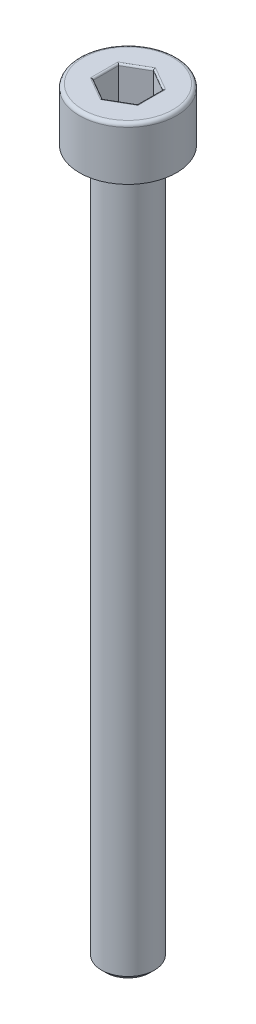
ISO-10303-21;
HEADER;
FILE_DESCRIPTION(('STEP AP214'),'2;1');
FILE_NAME('part.step','',(''),(''),'','','');
FILE_SCHEMA(('AUTOMOTIVE_DESIGN { 1 0 10303 214 1 1 1 1 }'));
ENDSEC;
DATA;
#1=APPLICATION_CONTEXT('core data for automotive mechanical design processes');
#2=APPLICATION_PROTOCOL_DEFINITION('international standard','automotive_design',2000,#1);
#3=PRODUCT_CONTEXT('',#1,'mechanical');
#4=PRODUCT('Part','Part','',(#3));
#5=PRODUCT_RELATED_PRODUCT_CATEGORY('part','',(#4));
#6=PRODUCT_DEFINITION_FORMATION('','',#4);
#7=PRODUCT_DEFINITION_CONTEXT('part definition',#1,'design');
#8=PRODUCT_DEFINITION('design','',#6,#7);
#9=PRODUCT_DEFINITION_SHAPE('','',#8);
#10=(LENGTH_UNIT() NAMED_UNIT(*) SI_UNIT(.MILLI.,.METRE.));
#11=(NAMED_UNIT(*) PLANE_ANGLE_UNIT() SI_UNIT($,.RADIAN.));
#12=(NAMED_UNIT(*) SI_UNIT($,.STERADIAN.) SOLID_ANGLE_UNIT());
#13=UNCERTAINTY_MEASURE_WITH_UNIT(LENGTH_MEASURE(1.E-05),#10,'distance_accuracy_value','');
#14=(GEOMETRIC_REPRESENTATION_CONTEXT(3) GLOBAL_UNCERTAINTY_ASSIGNED_CONTEXT((#13)) GLOBAL_UNIT_ASSIGNED_CONTEXT((#10,
#11,#12)) REPRESENTATION_CONTEXT('',''));
#15=CARTESIAN_POINT('',(0.,0.,0.));
#16=DIRECTION('',(0.,0.,1.));
#17=DIRECTION('',(1.,0.,0.));
#18=AXIS2_PLACEMENT_3D('',#15,#16,#17);
#19=CARTESIAN_POINT('',(0.,-43.,0.));
#20=DIRECTION('',(0.,-1.,0.));
#21=DIRECTION('',(0.,0.,-1.));
#22=AXIS2_PLACEMENT_3D('',#19,#20,#21);
#23=PLANE('',#22);
#24=CARTESIAN_POINT('',(0.,-43.,0.));
#25=DIRECTION('',(0.,-1.,0.));
#26=DIRECTION('',(0.,0.,-1.));
#27=AXIS2_PLACEMENT_3D('',#24,#25,#26);
#28=CIRCLE('',#27,1.24999999999999);
#29=CARTESIAN_POINT('',(0.,-43.,-1.24999999999999));
#30=VERTEX_POINT('',#29);
#31=EDGE_CURVE('E263',#30,#30,#28,.T.);
#32=ORIENTED_EDGE('',*,*,#31,.T.);
#33=EDGE_LOOP('',(#32));
#34=FACE_BOUND('',#33,.T.);
#35=ADVANCED_FACE('F35',(#34),#23,.T.);
#36=CARTESIAN_POINT('',(0.,0.,0.));
#37=DIRECTION('',(0.,1.,0.));
#38=DIRECTION('',(0.,0.,1.));
#39=AXIS2_PLACEMENT_3D('',#36,#37,#38);
#40=CYLINDRICAL_SURFACE('',#39,1.5);
#41=CARTESIAN_POINT('',(0.,-3.25000000000001,0.));
#42=DIRECTION('',(0.,-1.,0.));
#43=DIRECTION('',(0.,0.,-1.));
#44=AXIS2_PLACEMENT_3D('',#41,#42,#43);
#45=CIRCLE('',#44,1.5);
#46=CARTESIAN_POINT('',(0.,-3.25000000000001,-1.5));
#47=VERTEX_POINT('',#46);
#48=EDGE_CURVE('E260',#47,#47,#45,.T.);
#49=ORIENTED_EDGE('',*,*,#48,.T.);
#50=EDGE_LOOP('',(#49));
#51=FACE_BOUND('',#50,.T.);
#52=CARTESIAN_POINT('',(0.,-42.75,0.));
#53=DIRECTION('',(0.,-1.,0.));
#54=DIRECTION('',(0.,0.,-1.));
#55=AXIS2_PLACEMENT_3D('',#52,#53,#54);
#56=CIRCLE('',#55,1.5);
#57=CARTESIAN_POINT('',(0.,-42.75,-1.5));
#58=VERTEX_POINT('',#57);
#59=EDGE_CURVE('E257',#58,#58,#56,.F.);
#60=ORIENTED_EDGE('',*,*,#59,.T.);
#61=EDGE_LOOP('',(#60));
#62=FACE_BOUND('',#61,.T.);
#63=ADVANCED_FACE('F289',(#51,#62),#40,.T.);
#64=CARTESIAN_POINT('',(-1.5,-3.,0.));
#65=DIRECTION('',(0.,-1.,0.));
#66=DIRECTION('',(0.,0.,-1.));
#67=AXIS2_PLACEMENT_3D('',#64,#65,#66);
#68=PLANE('',#67);
#69=CARTESIAN_POINT('',(0.,-3.,0.));
#70=DIRECTION('',(0.,-1.,0.));
#71=DIRECTION('',(0.,0.,-1.));
#72=AXIS2_PLACEMENT_3D('',#69,#70,#71);
#73=CIRCLE('',#72,1.75000000000001);
#74=CARTESIAN_POINT('',(0.,-3.,-1.75000000000001));
#75=VERTEX_POINT('',#74);
#76=EDGE_CURVE('E254',#75,#75,#73,.F.);
#77=ORIENTED_EDGE('',*,*,#76,.T.);
#78=EDGE_LOOP('',(#77));
#79=FACE_BOUND('',#78,.T.);
#80=CARTESIAN_POINT('',(0.,-3.,0.));
#81=DIRECTION('',(0.,1.,0.));
#82=DIRECTION('',(0.,0.,1.));
#83=AXIS2_PLACEMENT_3D('',#80,#81,#82);
#84=CIRCLE('',#83,2.75);
#85=CARTESIAN_POINT('',(0.,-3.,2.75));
#86=VERTEX_POINT('',#85);
#87=EDGE_CURVE('E251',#86,#86,#84,.T.);
#88=ORIENTED_EDGE('',*,*,#87,.F.);
#89=EDGE_LOOP('',(#88));
#90=FACE_BOUND('',#89,.T.);
#91=ADVANCED_FACE('F295',(#79,#90),#68,.T.);
#92=CARTESIAN_POINT('',(0.,0.,0.));
#93=DIRECTION('',(0.,1.,0.));
#94=DIRECTION('',(0.,0.,1.));
#95=AXIS2_PLACEMENT_3D('',#92,#93,#94);
#96=CYLINDRICAL_SURFACE('',#95,2.75);
#97=CARTESIAN_POINT('',(0.,-0.2,0.));
#98=DIRECTION('',(0.,1.,0.));
#99=DIRECTION('',(0.,0.,1.));
#100=AXIS2_PLACEMENT_3D('',#97,#98,#99);
#101=CIRCLE('',#100,2.75);
#102=CARTESIAN_POINT('',(0.,-0.2,2.75));
#103=VERTEX_POINT('',#102);
#104=EDGE_CURVE('E161',#103,#103,#101,.F.);
#105=ORIENTED_EDGE('',*,*,#104,.T.);
#106=EDGE_LOOP('',(#105));
#107=FACE_BOUND('',#106,.T.);
#108=ORIENTED_EDGE('',*,*,#87,.T.);
#109=EDGE_LOOP('',(#108));
#110=FACE_BOUND('',#109,.T.);
#111=ADVANCED_FACE('F305',(#107,#110),#96,.T.);
#112=CARTESIAN_POINT('',(-2.75,0.,0.));
#113=DIRECTION('',(0.,1.,0.));
#114=DIRECTION('',(0.,0.,1.));
#115=AXIS2_PLACEMENT_3D('',#112,#113,#114);
#116=PLANE('',#115);
#117=DIRECTION('',(0.,0.,1.));
#118=VECTOR('',#117,1.);
#119=CARTESIAN_POINT('',(-1.35,0.,-0.721687836487033));
#120=LINE('',#119,#118);
#121=CARTESIAN_POINT('',(-1.35,0.,0.779422863405995));
#122=VERTEX_POINT('',#121);
#123=CARTESIAN_POINT('',(-1.35,0.,-0.779422863405995));
#124=VERTEX_POINT('',#123);
#125=EDGE_CURVE('E177',#122,#124,#120,.F.);
#126=ORIENTED_EDGE('',*,*,#125,.T.);
#127=DIRECTION('',(-0.866025403784439,0.,0.5));
#128=VECTOR('',#127,1.);
#129=CARTESIAN_POINT('',(-0.0500000000000002,0.,-1.52997821335251));
#130=LINE('',#129,#128);
#131=CARTESIAN_POINT('',(0.,0.,-1.55884572681199));
#132=VERTEX_POINT('',#131);
#133=EDGE_CURVE('E136',#124,#132,#130,.F.);
#134=ORIENTED_EDGE('',*,*,#133,.T.);
#135=DIRECTION('',(-0.866025403784439,0.,-0.5));
#136=VECTOR('',#135,1.);
#137=CARTESIAN_POINT('',(1.3,0.,-0.808290376865477));
#138=LINE('',#137,#136);
#139=CARTESIAN_POINT('',(1.35,0.,-0.779422863405995));
#140=VERTEX_POINT('',#139);
#141=EDGE_CURVE('E163',#132,#140,#138,.F.);
#142=ORIENTED_EDGE('',*,*,#141,.T.);
#143=DIRECTION('',(0.,0.,-1.));
#144=VECTOR('',#143,1.);
#145=CARTESIAN_POINT('',(1.35,0.,0.721687836487034));
#146=LINE('',#145,#144);
#147=CARTESIAN_POINT('',(1.35,0.,0.779422863405996));
#148=VERTEX_POINT('',#147);
#149=EDGE_CURVE('E171',#140,#148,#146,.F.);
#150=ORIENTED_EDGE('',*,*,#149,.T.);
#151=DIRECTION('',(0.866025403784439,0.,-0.5));
#152=VECTOR('',#151,1.);
#153=CARTESIAN_POINT('',(0.05,0.,1.52997821335251));
#154=LINE('',#153,#152);
#155=CARTESIAN_POINT('',(0.,0.,1.55884572681199));
#156=VERTEX_POINT('',#155);
#157=EDGE_CURVE('E173',#148,#156,#154,.F.);
#158=ORIENTED_EDGE('',*,*,#157,.T.);
#159=DIRECTION('',(0.866025403784438,0.,0.5));
#160=VECTOR('',#159,1.);
#161=CARTESIAN_POINT('',(-1.3,0.,0.808290376865476));
#162=LINE('',#161,#160);
#163=EDGE_CURVE('E175',#156,#122,#162,.F.);
#164=ORIENTED_EDGE('',*,*,#163,.T.);
#165=EDGE_LOOP('',(#126,#134,#142,#150,#158,#164));
#166=FACE_BOUND('',#165,.T.);
#167=CARTESIAN_POINT('',(0.,0.,0.));
#168=DIRECTION('',(0.,1.,0.));
#169=DIRECTION('',(0.,0.,1.));
#170=AXIS2_PLACEMENT_3D('',#167,#168,#169);
#171=CIRCLE('',#170,2.55);
#172=CARTESIAN_POINT('',(0.,0.,2.55));
#173=VERTEX_POINT('',#172);
#174=EDGE_CURVE('E166',#173,#173,#171,.T.);
#175=ORIENTED_EDGE('',*,*,#174,.T.);
#176=EDGE_LOOP('',(#175));
#177=FACE_BOUND('',#176,.T.);
#178=ADVANCED_FACE('F268',(#166,#177),#116,.T.);
#179=CARTESIAN_POINT('',(0.,-3.,0.));
#180=DIRECTION('',(0.,1.,0.));
#181=DIRECTION('',(0.,0.,1.));
#182=AXIS2_PLACEMENT_3D('',#179,#180,#181);
#183=CONICAL_SURFACE('',#182,1.75000000000001,0.785398163397452);
#184=ORIENTED_EDGE('',*,*,#48,.F.);
#185=EDGE_LOOP('',(#184));
#186=FACE_BOUND('',#185,.T.);
#187=ORIENTED_EDGE('',*,*,#76,.F.);
#188=EDGE_LOOP('',(#187));
#189=FACE_BOUND('',#188,.T.);
#190=ADVANCED_FACE('F283',(#186,#189),#183,.T.);
#191=CARTESIAN_POINT('',(0.,-42.75,0.));
#192=DIRECTION('',(0.,1.,0.));
#193=DIRECTION('',(0.,0.,1.));
#194=AXIS2_PLACEMENT_3D('',#191,#192,#193);
#195=CONICAL_SURFACE('',#194,1.5,0.785398163397472);
#196=ORIENTED_EDGE('',*,*,#31,.F.);
#197=EDGE_LOOP('',(#196));
#198=FACE_BOUND('',#197,.T.);
#199=ORIENTED_EDGE('',*,*,#59,.F.);
#200=EDGE_LOOP('',(#199));
#201=FACE_BOUND('',#200,.T.);
#202=ADVANCED_FACE('F273',(#198,#201),#195,.T.);
#203=CARTESIAN_POINT('',(0.,-0.2,0.));
#204=DIRECTION('',(0.,1.,0.));
#205=DIRECTION('',(0.,0.,1.));
#206=AXIS2_PLACEMENT_3D('',#203,#204,#205);
#207=TOROIDAL_SURFACE('',#206,2.55,0.2);
#208=ORIENTED_EDGE('',*,*,#104,.F.);
#209=EDGE_LOOP('',(#208));
#210=FACE_BOUND('',#209,.T.);
#211=ORIENTED_EDGE('',*,*,#174,.F.);
#212=EDGE_LOOP('',(#211));
#213=FACE_BOUND('',#212,.T.);
#214=ADVANCED_FACE('F270',(#210,#213),#207,.T.);
#215=CARTESIAN_POINT('',(1.25,-2.,-0.721687836487033));
#216=DIRECTION('',(0.5,0.,-0.866025403784439));
#217=DIRECTION('',(-0.866025403784439,0.,-0.5));
#218=AXIS2_PLACEMENT_3D('',#215,#216,#217);
#219=PLANE('',#218);
#220=DIRECTION('',(0.,1.,0.));
#221=VECTOR('',#220,1.);
#222=CARTESIAN_POINT('',(1.25,-2.,-0.721687836487033));
#223=LINE('',#222,#221);
#224=CARTESIAN_POINT('',(1.25,-1.9,-0.721687836487033));
#225=VERTEX_POINT('',#224);
#226=CARTESIAN_POINT('',(1.25,-0.1,-0.721687836487033));
#227=VERTEX_POINT('',#226);
#228=EDGE_CURVE('E245',#225,#227,#223,.T.);
#229=ORIENTED_EDGE('',*,*,#228,.T.);
#230=DIRECTION('',(-0.866025403784439,0.,-0.5));
#231=VECTOR('',#230,1.);
#232=CARTESIAN_POINT('',(0.,-0.1,-1.44337567297406));
#233=LINE('',#232,#231);
#234=CARTESIAN_POINT('',(0.,-0.1,-1.44337567297406));
#235=VERTEX_POINT('',#234);
#236=EDGE_CURVE('E197',#227,#235,#233,.T.);
#237=ORIENTED_EDGE('',*,*,#236,.T.);
#238=DIRECTION('',(0.,1.,0.));
#239=VECTOR('',#238,1.);
#240=CARTESIAN_POINT('',(0.,-2.,-1.44337567297406));
#241=LINE('',#240,#239);
#242=CARTESIAN_POINT('',(0.,-1.9,-1.44337567297406));
#243=VERTEX_POINT('',#242);
#244=EDGE_CURVE('E147',#243,#235,#241,.T.);
#245=ORIENTED_EDGE('',*,*,#244,.F.);
#246=DIRECTION('',(-0.866025403784439,0.,-0.5));
#247=VECTOR('',#246,1.);
#248=CARTESIAN_POINT('',(1.25,-1.9,-0.721687836487033));
#249=LINE('',#248,#247);
#250=EDGE_CURVE('E195',#243,#225,#249,.F.);
#251=ORIENTED_EDGE('',*,*,#250,.T.);
#252=EDGE_LOOP('',(#229,#237,#245,#251));
#253=FACE_BOUND('',#252,.T.);
#254=ADVANCED_FACE('F272',(#253),#219,.F.);
#255=CARTESIAN_POINT('',(1.25,-2.,0.721687836487034));
#256=DIRECTION('',(1.,0.,0.));
#257=DIRECTION('',(0.,0.,-1.));
#258=AXIS2_PLACEMENT_3D('',#255,#256,#257);
#259=PLANE('',#258);
#260=DIRECTION('',(0.,1.,0.));
#261=VECTOR('',#260,1.);
#262=CARTESIAN_POINT('',(1.25,-2.,0.721687836487034));
#263=LINE('',#262,#261);
#264=CARTESIAN_POINT('',(1.25,-1.9,0.721687836487034));
#265=VERTEX_POINT('',#264);
#266=CARTESIAN_POINT('',(1.25,-0.1,0.721687836487034));
#267=VERTEX_POINT('',#266);
#268=EDGE_CURVE('E242',#265,#267,#263,.T.);
#269=ORIENTED_EDGE('',*,*,#268,.T.);
#270=DIRECTION('',(0.,0.,-1.));
#271=VECTOR('',#270,1.);
#272=CARTESIAN_POINT('',(1.25,-0.1,-0.721687836487033));
#273=LINE('',#272,#271);
#274=EDGE_CURVE('E193',#267,#227,#273,.T.);
#275=ORIENTED_EDGE('',*,*,#274,.T.);
#276=ORIENTED_EDGE('',*,*,#228,.F.);
#277=DIRECTION('',(0.,0.,-1.));
#278=VECTOR('',#277,1.);
#279=CARTESIAN_POINT('',(1.25,-1.9,0.721687836487034));
#280=LINE('',#279,#278);
#281=EDGE_CURVE('E190',#225,#265,#280,.F.);
#282=ORIENTED_EDGE('',*,*,#281,.T.);
#283=EDGE_LOOP('',(#269,#275,#276,#282));
#284=FACE_BOUND('',#283,.T.);
#285=ADVANCED_FACE('F280',(#284),#259,.F.);
#286=CARTESIAN_POINT('',(0.,-2.,1.44337567297407));
#287=DIRECTION('',(0.5,0.,0.866025403784439));
#288=DIRECTION('',(0.866025403784439,0.,-0.5));
#289=AXIS2_PLACEMENT_3D('',#286,#287,#288);
#290=PLANE('',#289);
#291=DIRECTION('',(0.,1.,0.));
#292=VECTOR('',#291,1.);
#293=CARTESIAN_POINT('',(0.,-2.,1.44337567297407));
#294=LINE('',#293,#292);
#295=CARTESIAN_POINT('',(0.,-1.9,1.44337567297407));
#296=VERTEX_POINT('',#295);
#297=CARTESIAN_POINT('',(0.,-0.1,1.44337567297407));
#298=VERTEX_POINT('',#297);
#299=EDGE_CURVE('E239',#296,#298,#294,.T.);
#300=ORIENTED_EDGE('',*,*,#299,.T.);
#301=DIRECTION('',(0.866025403784439,0.,-0.5));
#302=VECTOR('',#301,1.);
#303=CARTESIAN_POINT('',(1.25,-0.1,0.721687836487034));
#304=LINE('',#303,#302);
#305=EDGE_CURVE('E188',#298,#267,#304,.T.);
#306=ORIENTED_EDGE('',*,*,#305,.T.);
#307=ORIENTED_EDGE('',*,*,#268,.F.);
#308=DIRECTION('',(0.866025403784439,0.,-0.5));
#309=VECTOR('',#308,1.);
#310=CARTESIAN_POINT('',(0.,-1.9,1.44337567297407));
#311=LINE('',#310,#309);
#312=EDGE_CURVE('E186',#265,#296,#311,.F.);
#313=ORIENTED_EDGE('',*,*,#312,.T.);
#314=EDGE_LOOP('',(#300,#306,#307,#313));
#315=FACE_BOUND('',#314,.T.);
#316=ADVANCED_FACE('F329',(#315),#290,.F.);
#317=CARTESIAN_POINT('',(-1.25,-2.,0.721687836487033));
#318=DIRECTION('',(-0.5,0.,0.866025403784439));
#319=DIRECTION('',(0.866025403784438,0.,0.5));
#320=AXIS2_PLACEMENT_3D('',#317,#318,#319);
#321=PLANE('',#320);
#322=DIRECTION('',(0.,1.,0.));
#323=VECTOR('',#322,1.);
#324=CARTESIAN_POINT('',(-1.25,-2.,0.721687836487033));
#325=LINE('',#324,#323);
#326=CARTESIAN_POINT('',(-1.25,-1.9,0.721687836487033));
#327=VERTEX_POINT('',#326);
#328=CARTESIAN_POINT('',(-1.25,-0.1,0.721687836487033));
#329=VERTEX_POINT('',#328);
#330=EDGE_CURVE('E130',#327,#329,#325,.T.);
#331=ORIENTED_EDGE('',*,*,#330,.T.);
#332=DIRECTION('',(0.866025403784438,0.,0.5));
#333=VECTOR('',#332,1.);
#334=CARTESIAN_POINT('',(0.,-0.1,1.44337567297407));
#335=LINE('',#334,#333);
#336=EDGE_CURVE('E184',#329,#298,#335,.T.);
#337=ORIENTED_EDGE('',*,*,#336,.T.);
#338=ORIENTED_EDGE('',*,*,#299,.F.);
#339=DIRECTION('',(0.866025403784438,0.,0.5));
#340=VECTOR('',#339,1.);
#341=CARTESIAN_POINT('',(-1.25,-1.9,0.721687836487033));
#342=LINE('',#341,#340);
#343=EDGE_CURVE('E182',#296,#327,#342,.F.);
#344=ORIENTED_EDGE('',*,*,#343,.T.);
#345=EDGE_LOOP('',(#331,#337,#338,#344));
#346=FACE_BOUND('',#345,.T.);
#347=ADVANCED_FACE('F236',(#346),#321,.F.);
#348=CARTESIAN_POINT('',(-1.25,-2.,-0.721687836487033));
#349=DIRECTION('',(-1.,0.,0.));
#350=DIRECTION('',(0.,0.,1.));
#351=AXIS2_PLACEMENT_3D('',#348,#349,#350);
#352=PLANE('',#351);
#353=DIRECTION('',(0.,1.,0.));
#354=VECTOR('',#353,1.);
#355=CARTESIAN_POINT('',(-1.25,-2.,-0.721687836487033));
#356=LINE('',#355,#354);
#357=CARTESIAN_POINT('',(-1.25,-1.9,-0.721687836487033));
#358=VERTEX_POINT('',#357);
#359=CARTESIAN_POINT('',(-1.25,-0.1,-0.721687836487033));
#360=VERTEX_POINT('',#359);
#361=EDGE_CURVE('E128',#358,#360,#356,.T.);
#362=ORIENTED_EDGE('',*,*,#361,.T.);
#363=DIRECTION('',(0.,0.,1.));
#364=VECTOR('',#363,1.);
#365=CARTESIAN_POINT('',(-1.25,-0.1,0.721687836487033));
#366=LINE('',#365,#364);
#367=EDGE_CURVE('E135',#360,#329,#366,.T.);
#368=ORIENTED_EDGE('',*,*,#367,.T.);
#369=ORIENTED_EDGE('',*,*,#330,.F.);
#370=DIRECTION('',(0.,0.,1.));
#371=VECTOR('',#370,1.);
#372=CARTESIAN_POINT('',(-1.25,-1.9,-0.721687836487033));
#373=LINE('',#372,#371);
#374=EDGE_CURVE('E125',#327,#358,#373,.F.);
#375=ORIENTED_EDGE('',*,*,#374,.T.);
#376=EDGE_LOOP('',(#362,#368,#369,#375));
#377=FACE_BOUND('',#376,.T.);
#378=ADVANCED_FACE('F127',(#377),#352,.F.);
#379=CARTESIAN_POINT('',(0.,-2.,-1.44337567297406));
#380=DIRECTION('',(-0.5,0.,-0.866025403784439));
#381=DIRECTION('',(-0.866025403784439,0.,0.5));
#382=AXIS2_PLACEMENT_3D('',#379,#380,#381);
#383=PLANE('',#382);
#384=ORIENTED_EDGE('',*,*,#244,.T.);
#385=DIRECTION('',(-0.866025403784439,0.,0.5));
#386=VECTOR('',#385,1.);
#387=CARTESIAN_POINT('',(-1.25,-0.1,-0.721687836487032));
#388=LINE('',#387,#386);
#389=EDGE_CURVE('E146',#235,#360,#388,.T.);
#390=ORIENTED_EDGE('',*,*,#389,.T.);
#391=ORIENTED_EDGE('',*,*,#361,.F.);
#392=DIRECTION('',(-0.866025403784439,0.,0.5));
#393=VECTOR('',#392,1.);
#394=CARTESIAN_POINT('',(0.,-1.9,-1.44337567297406));
#395=LINE('',#394,#393);
#396=EDGE_CURVE('E143',#358,#243,#395,.F.);
#397=ORIENTED_EDGE('',*,*,#396,.T.);
#398=EDGE_LOOP('',(#384,#390,#391,#397));
#399=FACE_BOUND('',#398,.T.);
#400=ADVANCED_FACE('F141',(#399),#383,.F.);
#401=CARTESIAN_POINT('',(1.25,-2.,-0.721687836487033));
#402=DIRECTION('',(0.,-1.,0.));
#403=DIRECTION('',(0.,0.,-1.));
#404=AXIS2_PLACEMENT_3D('',#401,#402,#403);
#405=PLANE('',#404);
#406=DIRECTION('',(0.866025403784439,0.,-0.5));
#407=VECTOR('',#406,1.);
#408=CARTESIAN_POINT('',(1.2,-2.,0.63508529610859));
#409=LINE('',#408,#407);
#410=CARTESIAN_POINT('',(0.,-2.,1.32790561913614));
#411=VERTEX_POINT('',#410);
#412=CARTESIAN_POINT('',(1.15,-2.,0.663952809568071));
#413=VERTEX_POINT('',#412);
#414=EDGE_CURVE('E44',#411,#413,#409,.T.);
#415=ORIENTED_EDGE('',*,*,#414,.T.);
#416=DIRECTION('',(0.,0.,-1.));
#417=VECTOR('',#416,1.);
#418=CARTESIAN_POINT('',(1.15,-2.,-0.721687836487033));
#419=LINE('',#418,#417);
#420=CARTESIAN_POINT('',(1.15,-2.,-0.66395280956807));
#421=VERTEX_POINT('',#420);
#422=EDGE_CURVE('E11',#413,#421,#419,.T.);
#423=ORIENTED_EDGE('',*,*,#422,.T.);
#424=DIRECTION('',(-0.866025403784439,0.,-0.5));
#425=VECTOR('',#424,1.);
#426=CARTESIAN_POINT('',(-0.0500000000000001,-2.,-1.35677313259562));
#427=LINE('',#426,#425);
#428=CARTESIAN_POINT('',(0.,-2.,-1.32790561913614));
#429=VERTEX_POINT('',#428);
#430=EDGE_CURVE('E199',#421,#429,#427,.T.);
#431=ORIENTED_EDGE('',*,*,#430,.T.);
#432=DIRECTION('',(-0.866025403784439,0.,0.5));
#433=VECTOR('',#432,1.);
#434=CARTESIAN_POINT('',(-1.2,-2.,-0.635085296108588));
#435=LINE('',#434,#433);
#436=CARTESIAN_POINT('',(-1.15,-2.,-0.66395280956807));
#437=VERTEX_POINT('',#436);
#438=EDGE_CURVE('E201',#429,#437,#435,.T.);
#439=ORIENTED_EDGE('',*,*,#438,.T.);
#440=DIRECTION('',(0.,0.,1.));
#441=VECTOR('',#440,1.);
#442=CARTESIAN_POINT('',(-1.15,-2.,0.721687836487033));
#443=LINE('',#442,#441);
#444=CARTESIAN_POINT('',(-1.15,-2.,0.66395280956807));
#445=VERTEX_POINT('',#444);
#446=EDGE_CURVE('E152',#437,#445,#443,.T.);
#447=ORIENTED_EDGE('',*,*,#446,.T.);
#448=DIRECTION('',(0.866025403784438,0.,0.5));
#449=VECTOR('',#448,1.);
#450=CARTESIAN_POINT('',(0.0499999999999999,-2.,1.35677313259562));
#451=LINE('',#450,#449);
#452=EDGE_CURVE('E55',#445,#411,#451,.T.);
#453=ORIENTED_EDGE('',*,*,#452,.T.);
#454=EDGE_LOOP('',(#415,#423,#431,#439,#447,#453));
#455=FACE_BOUND('',#454,.T.);
#456=ADVANCED_FACE('F324',(#455),#405,.F.);
#457=CARTESIAN_POINT('',(0.05,-0.1,1.52997821335251));
#458=DIRECTION('',(-0.866025403784439,0.,0.5));
#459=DIRECTION('',(0.5,0.,0.866025403784439));
#460=AXIS2_PLACEMENT_3D('',#457,#458,#459);
#461=CYLINDRICAL_SURFACE('',#460,0.1);
#462=CARTESIAN_POINT('',(0.,-0.1,1.55884572681199));
#463=DIRECTION('',(-1.,0.,0.));
#464=DIRECTION('',(0.,0.,-1.));
#465=AXIS2_PLACEMENT_3D('',#462,#463,#464);
#466=ELLIPSE('',#465,0.115470053837925,0.1);
#467=EDGE_CURVE('E216',#156,#298,#466,.T.);
#468=ORIENTED_EDGE('',*,*,#467,.F.);
#469=ORIENTED_EDGE('',*,*,#157,.F.);
#470=CARTESIAN_POINT('',(1.35,-0.1,0.779422863405997));
#471=DIRECTION('',(-0.5,0.,0.866025403784438));
#472=DIRECTION('',(-0.866025403784438,0.,-0.5));
#473=AXIS2_PLACEMENT_3D('',#470,#471,#472);
#474=ELLIPSE('',#473,0.115470053837925,0.1);
#475=EDGE_CURVE('E219',#267,#148,#474,.F.);
#476=ORIENTED_EDGE('',*,*,#475,.F.);
#477=ORIENTED_EDGE('',*,*,#305,.F.);
#478=EDGE_LOOP('',(#468,#469,#476,#477));
#479=FACE_BOUND('',#478,.T.);
#480=ADVANCED_FACE('F336',(#479),#461,.T.);
#481=CARTESIAN_POINT('',(1.35,-0.1,0.721687836487034));
#482=DIRECTION('',(0.,0.,1.));
#483=DIRECTION('',(1.,0.,0.));
#484=AXIS2_PLACEMENT_3D('',#481,#482,#483);
#485=CYLINDRICAL_SURFACE('',#484,0.1);
#486=ORIENTED_EDGE('',*,*,#475,.T.);
#487=ORIENTED_EDGE('',*,*,#149,.F.);
#488=CARTESIAN_POINT('',(1.35,-0.1,-0.779422863405995));
#489=DIRECTION('',(0.5,0.,0.866025403784439));
#490=DIRECTION('',(-0.866025403784439,0.,0.5));
#491=AXIS2_PLACEMENT_3D('',#488,#489,#490);
#492=ELLIPSE('',#491,0.115470053837925,0.1);
#493=EDGE_CURVE('E213',#227,#140,#492,.F.);
#494=ORIENTED_EDGE('',*,*,#493,.F.);
#495=ORIENTED_EDGE('',*,*,#274,.F.);
#496=EDGE_LOOP('',(#486,#487,#494,#495));
#497=FACE_BOUND('',#496,.T.);
#498=ADVANCED_FACE('F340',(#497),#485,.T.);
#499=CARTESIAN_POINT('',(-1.3,-0.1,0.808290376865476));
#500=DIRECTION('',(-0.866025403784438,0.,-0.5));
#501=DIRECTION('',(-0.5,0.,0.866025403784439));
#502=AXIS2_PLACEMENT_3D('',#499,#500,#501);
#503=CYLINDRICAL_SURFACE('',#502,0.1);
#504=ORIENTED_EDGE('',*,*,#467,.T.);
#505=ORIENTED_EDGE('',*,*,#336,.F.);
#506=CARTESIAN_POINT('',(-1.35,-0.1,0.779422863405995));
#507=DIRECTION('',(-0.5,0.,-0.866025403784439));
#508=DIRECTION('',(0.866025403784439,0.,-0.5));
#509=AXIS2_PLACEMENT_3D('',#506,#507,#508);
#510=ELLIPSE('',#509,0.115470053837925,0.1);
#511=EDGE_CURVE('E210',#122,#329,#510,.T.);
#512=ORIENTED_EDGE('',*,*,#511,.F.);
#513=ORIENTED_EDGE('',*,*,#163,.F.);
#514=EDGE_LOOP('',(#504,#505,#512,#513));
#515=FACE_BOUND('',#514,.T.);
#516=ADVANCED_FACE('F346',(#515),#503,.T.);
#517=CARTESIAN_POINT('',(1.3,-0.1,-0.808290376865477));
#518=DIRECTION('',(0.866025403784439,0.,0.5));
#519=DIRECTION('',(0.5,0.,-0.866025403784439));
#520=AXIS2_PLACEMENT_3D('',#517,#518,#519);
#521=CYLINDRICAL_SURFACE('',#520,0.1);
#522=ORIENTED_EDGE('',*,*,#493,.T.);
#523=ORIENTED_EDGE('',*,*,#141,.F.);
#524=CARTESIAN_POINT('',(0.,-0.1,-1.55884572681199));
#525=DIRECTION('',(1.,0.,0.));
#526=DIRECTION('',(0.,0.,-1.));
#527=AXIS2_PLACEMENT_3D('',#524,#525,#526);
#528=ELLIPSE('',#527,0.115470053837925,0.1);
#529=EDGE_CURVE('E208',#235,#132,#528,.F.);
#530=ORIENTED_EDGE('',*,*,#529,.F.);
#531=ORIENTED_EDGE('',*,*,#236,.F.);
#532=EDGE_LOOP('',(#522,#523,#530,#531));
#533=FACE_BOUND('',#532,.T.);
#534=ADVANCED_FACE('F376',(#533),#521,.T.);
#535=CARTESIAN_POINT('',(-1.35,-0.1,-0.721687836487033));
#536=DIRECTION('',(0.,0.,-1.));
#537=DIRECTION('',(-1.,0.,0.));
#538=AXIS2_PLACEMENT_3D('',#535,#536,#537);
#539=CYLINDRICAL_SURFACE('',#538,0.1);
#540=ORIENTED_EDGE('',*,*,#511,.T.);
#541=ORIENTED_EDGE('',*,*,#367,.F.);
#542=CARTESIAN_POINT('',(-1.35,-0.1,-0.779422863405995));
#543=DIRECTION('',(0.5,0.,-0.866025403784439));
#544=DIRECTION('',(0.866025403784439,0.,0.5));
#545=AXIS2_PLACEMENT_3D('',#542,#543,#544);
#546=ELLIPSE('',#545,0.115470053837925,0.1);
#547=EDGE_CURVE('E206',#124,#360,#546,.T.);
#548=ORIENTED_EDGE('',*,*,#547,.F.);
#549=ORIENTED_EDGE('',*,*,#125,.F.);
#550=EDGE_LOOP('',(#540,#541,#548,#549));
#551=FACE_BOUND('',#550,.T.);
#552=ADVANCED_FACE('F371',(#551),#539,.T.);
#553=CARTESIAN_POINT('',(-0.05,-0.1,-1.52997821335251));
#554=DIRECTION('',(0.866025403784439,0.,-0.5));
#555=DIRECTION('',(-0.5,0.,-0.866025403784439));
#556=AXIS2_PLACEMENT_3D('',#553,#554,#555);
#557=CYLINDRICAL_SURFACE('',#556,0.1);
#558=ORIENTED_EDGE('',*,*,#529,.T.);
#559=ORIENTED_EDGE('',*,*,#133,.F.);
#560=ORIENTED_EDGE('',*,*,#547,.T.);
#561=ORIENTED_EDGE('',*,*,#389,.F.);
#562=EDGE_LOOP('',(#558,#559,#560,#561));
#563=FACE_BOUND('',#562,.T.);
#564=ADVANCED_FACE('F367',(#563),#557,.T.);
#565=CARTESIAN_POINT('',(-1.15,-1.9,-0.721687836487033));
#566=DIRECTION('',(0.,0.,-1.));
#567=DIRECTION('',(-1.,0.,0.));
#568=AXIS2_PLACEMENT_3D('',#565,#566,#567);
#569=CYLINDRICAL_SURFACE('',#568,0.1);
#570=CARTESIAN_POINT('',(-1.15,-1.9,-0.663952809568069));
#571=DIRECTION('',(0.5,0.,-0.866025403784439));
#572=DIRECTION('',(-0.866025403784439,0.,-0.5));
#573=AXIS2_PLACEMENT_3D('',#570,#571,#572);
#574=ELLIPSE('',#573,0.115470053837925,0.1);
#575=EDGE_CURVE('E151',#358,#437,#574,.F.);
#576=ORIENTED_EDGE('',*,*,#575,.F.);
#577=ORIENTED_EDGE('',*,*,#374,.F.);
#578=CARTESIAN_POINT('',(-1.15,-1.9,0.66395280956807));
#579=DIRECTION('',(-0.5,0.,-0.866025403784439));
#580=DIRECTION('',(-0.866025403784439,0.,0.5));
#581=AXIS2_PLACEMENT_3D('',#578,#579,#580);
#582=ELLIPSE('',#581,0.115470053837925,0.1);
#583=EDGE_CURVE('E39',#445,#327,#582,.T.);
#584=ORIENTED_EDGE('',*,*,#583,.F.);
#585=ORIENTED_EDGE('',*,*,#446,.F.);
#586=EDGE_LOOP('',(#576,#577,#584,#585));
#587=FACE_BOUND('',#586,.T.);
#588=ADVANCED_FACE('F37',(#587),#569,.F.);
#589=CARTESIAN_POINT('',(0.0499999999999988,-1.9,1.35677313259562));
#590=DIRECTION('',(-0.866025403784438,0.,-0.5));
#591=DIRECTION('',(-0.5,0.,0.866025403784439));
#592=AXIS2_PLACEMENT_3D('',#589,#590,#591);
#593=CYLINDRICAL_SURFACE('',#592,0.1);
#594=ORIENTED_EDGE('',*,*,#583,.T.);
#595=ORIENTED_EDGE('',*,*,#343,.F.);
#596=CARTESIAN_POINT('',(0.,-1.9,1.32790561913614));
#597=DIRECTION('',(-1.,0.,0.));
#598=DIRECTION('',(0.,0.,1.));
#599=AXIS2_PLACEMENT_3D('',#596,#597,#598);
#600=ELLIPSE('',#599,0.115470053837925,0.1);
#601=EDGE_CURVE('E155',#411,#296,#600,.T.);
#602=ORIENTED_EDGE('',*,*,#601,.F.);
#603=ORIENTED_EDGE('',*,*,#452,.F.);
#604=EDGE_LOOP('',(#594,#595,#602,#603));
#605=FACE_BOUND('',#604,.T.);
#606=ADVANCED_FACE('F233',(#605),#593,.F.);
#607=CARTESIAN_POINT('',(0.675,-1.9,-1.71761705083914));
#608=DIRECTION('',(0.866025403784439,0.,-0.5));
#609=DIRECTION('',(-0.5,0.,-0.866025403784439));
#610=AXIS2_PLACEMENT_3D('',#607,#608,#609);
#611=CYLINDRICAL_SURFACE('',#610,0.1);
#612=ORIENTED_EDGE('',*,*,#575,.T.);
#613=ORIENTED_EDGE('',*,*,#438,.F.);
#614=CARTESIAN_POINT('',(0.,-1.9,-1.32790561913614));
#615=DIRECTION('',(1.,0.,0.));
#616=DIRECTION('',(0.,0.,-1.));
#617=AXIS2_PLACEMENT_3D('',#614,#615,#616);
#618=ELLIPSE('',#617,0.115470053837925,0.1);
#619=EDGE_CURVE('E159',#243,#429,#618,.F.);
#620=ORIENTED_EDGE('',*,*,#619,.F.);
#621=ORIENTED_EDGE('',*,*,#396,.F.);
#622=EDGE_LOOP('',(#612,#613,#620,#621));
#623=FACE_BOUND('',#622,.T.);
#624=ADVANCED_FACE('F157',(#623),#611,.F.);
#625=CARTESIAN_POINT('',(1.825,-1.9,0.274241377865074));
#626=DIRECTION('',(-0.866025403784439,0.,0.5));
#627=DIRECTION('',(0.5,0.,0.866025403784439));
#628=AXIS2_PLACEMENT_3D('',#625,#626,#627);
#629=CYLINDRICAL_SURFACE('',#628,0.1);
#630=ORIENTED_EDGE('',*,*,#601,.T.);
#631=ORIENTED_EDGE('',*,*,#312,.F.);
#632=CARTESIAN_POINT('',(1.15,-1.9,0.663952809568072));
#633=DIRECTION('',(-0.5,0.,0.866025403784438));
#634=DIRECTION('',(0.866025403784438,0.,0.5));
#635=AXIS2_PLACEMENT_3D('',#632,#633,#634);
#636=ELLIPSE('',#635,0.115470053837925,0.1);
#637=EDGE_CURVE('E224',#413,#265,#636,.T.);
#638=ORIENTED_EDGE('',*,*,#637,.F.);
#639=ORIENTED_EDGE('',*,*,#414,.F.);
#640=EDGE_LOOP('',(#630,#631,#638,#639));
#641=FACE_BOUND('',#640,.T.);
#642=ADVANCED_FACE('F230',(#641),#629,.F.);
#643=CARTESIAN_POINT('',(1.2,-1.9,-0.635085296108589));
#644=DIRECTION('',(0.866025403784439,0.,0.5));
#645=DIRECTION('',(0.5,0.,-0.866025403784439));
#646=AXIS2_PLACEMENT_3D('',#643,#644,#645);
#647=CYLINDRICAL_SURFACE('',#646,0.1);
#648=ORIENTED_EDGE('',*,*,#619,.T.);
#649=ORIENTED_EDGE('',*,*,#430,.F.);
#650=CARTESIAN_POINT('',(1.15,-1.9,-0.66395280956807));
#651=DIRECTION('',(0.5,0.,0.866025403784439));
#652=DIRECTION('',(-0.866025403784439,0.,0.5));
#653=AXIS2_PLACEMENT_3D('',#650,#651,#652);
#654=ELLIPSE('',#653,0.115470053837925,0.1);
#655=EDGE_CURVE('E222',#225,#421,#654,.F.);
#656=ORIENTED_EDGE('',*,*,#655,.F.);
#657=ORIENTED_EDGE('',*,*,#250,.F.);
#658=EDGE_LOOP('',(#648,#649,#656,#657));
#659=FACE_BOUND('',#658,.T.);
#660=ADVANCED_FACE('F355',(#659),#647,.F.);
#661=CARTESIAN_POINT('',(1.15,-1.9,-0.721687836487033));
#662=DIRECTION('',(0.,0.,1.));
#663=DIRECTION('',(1.,0.,0.));
#664=AXIS2_PLACEMENT_3D('',#661,#662,#663);
#665=CYLINDRICAL_SURFACE('',#664,0.1);
#666=ORIENTED_EDGE('',*,*,#637,.T.);
#667=ORIENTED_EDGE('',*,*,#281,.F.);
#668=ORIENTED_EDGE('',*,*,#655,.T.);
#669=ORIENTED_EDGE('',*,*,#422,.F.);
#670=EDGE_LOOP('',(#666,#667,#668,#669));
#671=FACE_BOUND('',#670,.T.);
#672=ADVANCED_FACE('F352',(#671),#665,.F.);
#673=CLOSED_SHELL('',(#35,#63,#91,#111,#178,#190,#202,#214,#254,#285,#316,#347,#378,#400,#456,
#480,#498,#516,#534,#552,#564,#588,#606,#624,#642,#660,#672));
#674=MANIFOLD_SOLID_BREP('B2',#673);
#675=ADVANCED_BREP_SHAPE_REPRESENTATION('',(#18,#674),#14);
#676=SHAPE_DEFINITION_REPRESENTATION(#9,#675);
ENDSEC;
END-ISO-10303-21;
